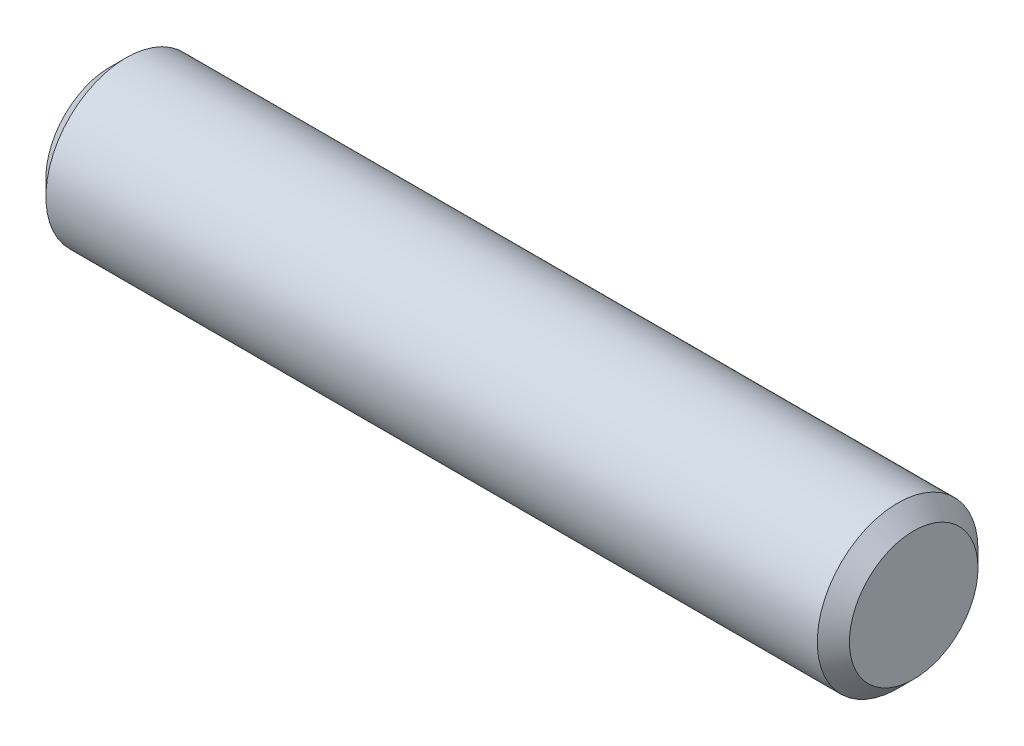
ISO-10303-21;
HEADER;
FILE_DESCRIPTION(('STEP AP214'),'2;1');
FILE_NAME('part.step','',(''),(''),'','','');
FILE_SCHEMA(('AUTOMOTIVE_DESIGN { 1 0 10303 214 1 1 1 1 }'));
ENDSEC;
DATA;
#1=APPLICATION_CONTEXT('core data for automotive mechanical design processes');
#2=APPLICATION_PROTOCOL_DEFINITION('international standard','automotive_design',2000,#1);
#3=PRODUCT_CONTEXT('',#1,'mechanical');
#4=PRODUCT('Part','Part','',(#3));
#5=PRODUCT_RELATED_PRODUCT_CATEGORY('part','',(#4));
#6=PRODUCT_DEFINITION_FORMATION('','',#4);
#7=PRODUCT_DEFINITION_CONTEXT('part definition',#1,'design');
#8=PRODUCT_DEFINITION('design','',#6,#7);
#9=PRODUCT_DEFINITION_SHAPE('','',#8);
#10=(LENGTH_UNIT() NAMED_UNIT(*) SI_UNIT(.MILLI.,.METRE.));
#11=(NAMED_UNIT(*) PLANE_ANGLE_UNIT() SI_UNIT($,.RADIAN.));
#12=(NAMED_UNIT(*) SI_UNIT($,.STERADIAN.) SOLID_ANGLE_UNIT());
#13=UNCERTAINTY_MEASURE_WITH_UNIT(LENGTH_MEASURE(1.E-05),#10,'distance_accuracy_value','');
#14=(GEOMETRIC_REPRESENTATION_CONTEXT(3) GLOBAL_UNCERTAINTY_ASSIGNED_CONTEXT((#13)) GLOBAL_UNIT_ASSIGNED_CONTEXT((#10,
#11,#12)) REPRESENTATION_CONTEXT('',''));
#15=CARTESIAN_POINT('',(0.,0.,0.));
#16=DIRECTION('',(0.,0.,1.));
#17=DIRECTION('',(1.,0.,0.));
#18=AXIS2_PLACEMENT_3D('',#15,#16,#17);
#19=CARTESIAN_POINT('',(-7.93750000000001,0.,0.));
#20=DIRECTION('',(1.,0.,0.));
#21=DIRECTION('',(0.,0.,-1.));
#22=AXIS2_PLACEMENT_3D('',#19,#20,#21);
#23=CYLINDRICAL_SURFACE('',#22,1.5875);
#24=CARTESIAN_POINT('',(7.61999999999999,0.,0.));
#25=DIRECTION('',(1.,0.,0.));
#26=DIRECTION('',(0.,0.,-1.));
#27=AXIS2_PLACEMENT_3D('',#24,#25,#26);
#28=CIRCLE('',#27,1.5875);
#29=CARTESIAN_POINT('',(7.61999999999999,0.,-1.5875));
#30=VERTEX_POINT('',#29);
#31=EDGE_CURVE('E54',#30,#30,#28,.F.);
#32=ORIENTED_EDGE('',*,*,#31,.T.);
#33=EDGE_LOOP('',(#32));
#34=FACE_BOUND('',#33,.T.);
#35=CARTESIAN_POINT('',(-7.61999999999999,0.,0.));
#36=DIRECTION('',(1.,0.,0.));
#37=DIRECTION('',(0.,0.,-1.));
#38=AXIS2_PLACEMENT_3D('',#35,#36,#37);
#39=CIRCLE('',#38,1.5875);
#40=CARTESIAN_POINT('',(-7.61999999999999,0.,-1.5875));
#41=VERTEX_POINT('',#40);
#42=EDGE_CURVE('E58',#41,#41,#39,.T.);
#43=ORIENTED_EDGE('',*,*,#42,.T.);
#44=EDGE_LOOP('',(#43));
#45=FACE_BOUND('',#44,.T.);
#46=ADVANCED_FACE('F47',(#34,#45),#23,.T.);
#47=CARTESIAN_POINT('',(-7.93750000000001,0.,0.));
#48=DIRECTION('',(1.,0.,0.));
#49=DIRECTION('',(0.,0.,-1.));
#50=AXIS2_PLACEMENT_3D('',#47,#48,#49);
#51=PLANE('',#50);
#52=CARTESIAN_POINT('',(-7.93750000000001,0.,0.));
#53=DIRECTION('',(1.,0.,0.));
#54=DIRECTION('',(0.,0.,-1.));
#55=AXIS2_PLACEMENT_3D('',#52,#53,#54);
#56=CIRCLE('',#55,1.27);
#57=CARTESIAN_POINT('',(-7.93750000000001,0.,-1.27));
#58=VERTEX_POINT('',#57);
#59=EDGE_CURVE('E12',#58,#58,#56,.F.);
#60=ORIENTED_EDGE('',*,*,#59,.T.);
#61=EDGE_LOOP('',(#60));
#62=FACE_BOUND('',#61,.T.);
#63=ADVANCED_FACE('F78',(#62),#51,.F.);
#64=CARTESIAN_POINT('',(7.93750000000001,0.,0.));
#65=DIRECTION('',(1.,0.,0.));
#66=DIRECTION('',(0.,0.,-1.));
#67=AXIS2_PLACEMENT_3D('',#64,#65,#66);
#68=PLANE('',#67);
#69=CARTESIAN_POINT('',(7.93750000000001,0.,0.));
#70=DIRECTION('',(1.,0.,0.));
#71=DIRECTION('',(0.,0.,-1.));
#72=AXIS2_PLACEMENT_3D('',#69,#70,#71);
#73=CIRCLE('',#72,1.27);
#74=CARTESIAN_POINT('',(7.93750000000001,0.,-1.27));
#75=VERTEX_POINT('',#74);
#76=EDGE_CURVE('E62',#75,#75,#73,.T.);
#77=ORIENTED_EDGE('',*,*,#76,.T.);
#78=EDGE_LOOP('',(#77));
#79=FACE_BOUND('',#78,.T.);
#80=ADVANCED_FACE('F68',(#79),#68,.T.);
#81=CARTESIAN_POINT('',(7.93750000000001,0.,0.));
#82=DIRECTION('',(-1.,0.,0.));
#83=DIRECTION('',(0.,0.,1.));
#84=AXIS2_PLACEMENT_3D('',#81,#82,#83);
#85=CONICAL_SURFACE('',#84,1.27,0.785398163397445);
#86=ORIENTED_EDGE('',*,*,#31,.F.);
#87=EDGE_LOOP('',(#86));
#88=FACE_BOUND('',#87,.T.);
#89=ORIENTED_EDGE('',*,*,#76,.F.);
#90=EDGE_LOOP('',(#89));
#91=FACE_BOUND('',#90,.T.);
#92=ADVANCED_FACE('F70',(#88,#91),#85,.T.);
#93=CARTESIAN_POINT('',(-7.61999999999999,0.,0.));
#94=DIRECTION('',(1.,0.,0.));
#95=DIRECTION('',(0.,0.,-1.));
#96=AXIS2_PLACEMENT_3D('',#93,#94,#95);
#97=CONICAL_SURFACE('',#96,1.5875,0.78539816339745);
#98=ORIENTED_EDGE('',*,*,#59,.F.);
#99=EDGE_LOOP('',(#98));
#100=FACE_BOUND('',#99,.T.);
#101=ORIENTED_EDGE('',*,*,#42,.F.);
#102=EDGE_LOOP('',(#101));
#103=FACE_BOUND('',#102,.T.);
#104=ADVANCED_FACE('F49',(#100,#103),#97,.T.);
#105=CLOSED_SHELL('',(#46,#63,#80,#92,#104));
#106=MANIFOLD_SOLID_BREP('B2',#105);
#107=ADVANCED_BREP_SHAPE_REPRESENTATION('',(#18,#106),#14);
#108=SHAPE_DEFINITION_REPRESENTATION(#9,#107);
ENDSEC;
END-ISO-10303-21;
